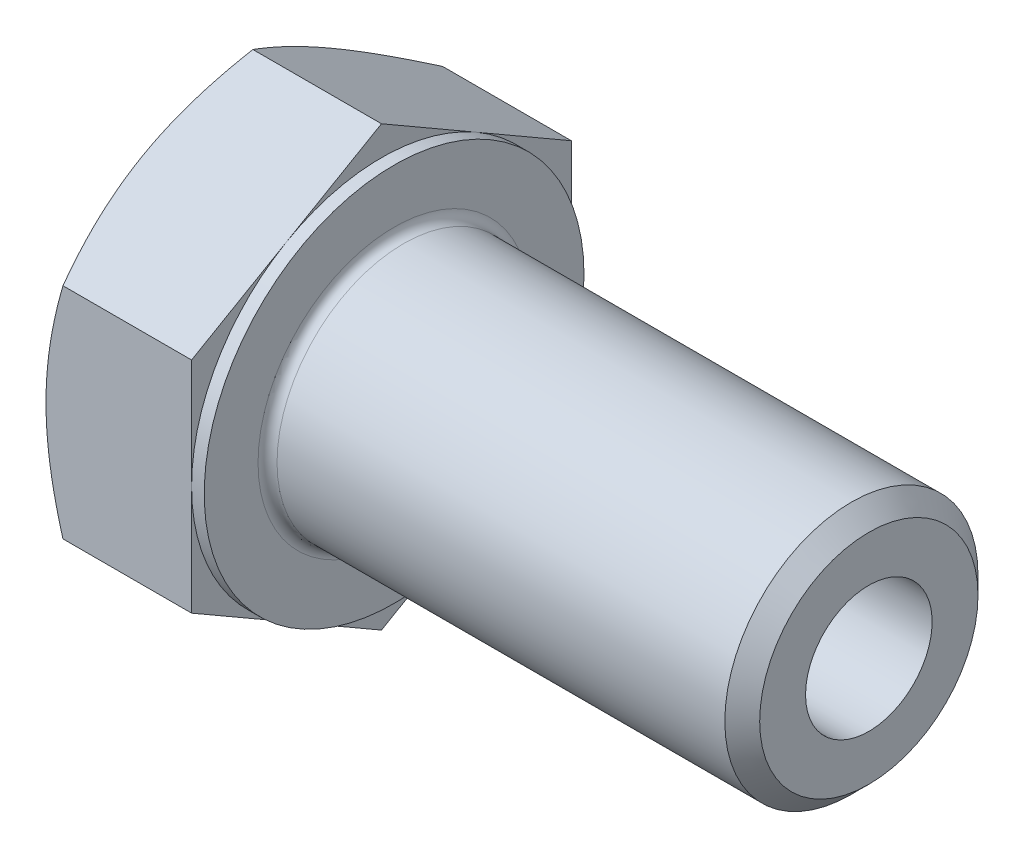
ISO-10303-21;
HEADER;
FILE_DESCRIPTION(('STEP AP214'),'2;1');
FILE_NAME('part.step','',(''),(''),'','','');
FILE_SCHEMA(('AUTOMOTIVE_DESIGN { 1 0 10303 214 1 1 1 1 }'));
ENDSEC;
DATA;
#1=APPLICATION_CONTEXT('core data for automotive mechanical design processes');
#2=APPLICATION_PROTOCOL_DEFINITION('international standard','automotive_design',2000,#1);
#3=PRODUCT_CONTEXT('',#1,'mechanical');
#4=PRODUCT('Part','Part','',(#3));
#5=PRODUCT_RELATED_PRODUCT_CATEGORY('part','',(#4));
#6=PRODUCT_DEFINITION_FORMATION('','',#4);
#7=PRODUCT_DEFINITION_CONTEXT('part definition',#1,'design');
#8=PRODUCT_DEFINITION('design','',#6,#7);
#9=PRODUCT_DEFINITION_SHAPE('','',#8);
#10=(LENGTH_UNIT() NAMED_UNIT(*) SI_UNIT(.MILLI.,.METRE.));
#11=(NAMED_UNIT(*) PLANE_ANGLE_UNIT() SI_UNIT($,.RADIAN.));
#12=(NAMED_UNIT(*) SI_UNIT($,.STERADIAN.) SOLID_ANGLE_UNIT());
#13=UNCERTAINTY_MEASURE_WITH_UNIT(LENGTH_MEASURE(1.E-05),#10,'distance_accuracy_value','');
#14=(GEOMETRIC_REPRESENTATION_CONTEXT(3) GLOBAL_UNCERTAINTY_ASSIGNED_CONTEXT((#13)) GLOBAL_UNIT_ASSIGNED_CONTEXT((#10,
#11,#12)) REPRESENTATION_CONTEXT('',''));
#15=CARTESIAN_POINT('',(0.,0.,0.));
#16=DIRECTION('',(0.,0.,1.));
#17=DIRECTION('',(1.,0.,0.));
#18=AXIS2_PLACEMENT_3D('',#15,#16,#17);
#19=CARTESIAN_POINT('',(10.,13.856406460551,0.));
#20=DIRECTION('',(1.,0.,0.));
#21=DIRECTION('',(0.,0.,-1.));
#22=AXIS2_PLACEMENT_3D('',#19,#20,#21);
#23=PLANE('',#22);
#24=CARTESIAN_POINT('',(10.,0.,0.));
#25=DIRECTION('',(1.,0.,0.));
#26=DIRECTION('',(0.,0.,-1.));
#27=AXIS2_PLACEMENT_3D('',#24,#25,#26);
#28=CIRCLE('',#27,8.6);
#29=CARTESIAN_POINT('',(10.,0.,-8.6));
#30=VERTEX_POINT('',#29);
#31=EDGE_CURVE('E50',#30,#30,#28,.F.);
#32=ORIENTED_EDGE('',*,*,#31,.T.);
#33=EDGE_LOOP('',(#32));
#34=FACE_BOUND('',#33,.T.);
#35=CARTESIAN_POINT('',(10.,0.,0.));
#36=DIRECTION('',(1.,0.,0.));
#37=DIRECTION('',(0.,0.,-1.));
#38=AXIS2_PLACEMENT_3D('',#35,#36,#37);
#39=CIRCLE('',#38,12.);
#40=CARTESIAN_POINT('',(10.,0.,-12.));
#41=VERTEX_POINT('',#40);
#42=EDGE_CURVE('E335',#41,#41,#39,.T.);
#43=ORIENTED_EDGE('',*,*,#42,.T.);
#44=EDGE_LOOP('',(#43));
#45=FACE_BOUND('',#44,.T.);
#46=ADVANCED_FACE('F41',(#34,#45),#23,.T.);
#47=CARTESIAN_POINT('',(0.,0.,0.));
#48=DIRECTION('',(-1.,0.,0.));
#49=DIRECTION('',(0.,0.,1.));
#50=AXIS2_PLACEMENT_3D('',#47,#48,#49);
#51=CYLINDRICAL_SURFACE('',#50,8.);
#52=CARTESIAN_POINT('',(10.6,0.,0.));
#53=DIRECTION('',(1.,0.,0.));
#54=DIRECTION('',(0.,0.,-1.));
#55=AXIS2_PLACEMENT_3D('',#52,#53,#54);
#56=CIRCLE('',#55,8.);
#57=CARTESIAN_POINT('',(10.6,0.,-8.));
#58=VERTEX_POINT('',#57);
#59=EDGE_CURVE('E11',#58,#58,#56,.T.);
#60=ORIENTED_EDGE('',*,*,#59,.T.);
#61=EDGE_LOOP('',(#60));
#62=FACE_BOUND('',#61,.T.);
#63=CARTESIAN_POINT('',(38.8985,0.,0.));
#64=DIRECTION('',(-1.,0.,0.));
#65=DIRECTION('',(0.,0.,1.));
#66=AXIS2_PLACEMENT_3D('',#63,#64,#65);
#67=CIRCLE('',#66,8.);
#68=CARTESIAN_POINT('',(38.8985,0.,8.));
#69=VERTEX_POINT('',#68);
#70=EDGE_CURVE('E305',#69,#69,#67,.T.);
#71=ORIENTED_EDGE('',*,*,#70,.T.);
#72=EDGE_LOOP('',(#71));
#73=FACE_BOUND('',#72,.T.);
#74=ADVANCED_FACE('F273',(#62,#73),#51,.T.);
#75=CARTESIAN_POINT('',(40.,0.,0.));
#76=DIRECTION('',(-1.,0.,0.));
#77=DIRECTION('',(0.,0.,1.));
#78=AXIS2_PLACEMENT_3D('',#75,#76,#77);
#79=CONICAL_SURFACE('',#78,6.8985,0.785398163397439);
#80=ORIENTED_EDGE('',*,*,#70,.F.);
#81=EDGE_LOOP('',(#80));
#82=FACE_BOUND('',#81,.T.);
#83=CARTESIAN_POINT('',(40.,0.,0.));
#84=DIRECTION('',(-1.,0.,0.));
#85=DIRECTION('',(0.,0.,1.));
#86=AXIS2_PLACEMENT_3D('',#83,#84,#85);
#87=CIRCLE('',#86,6.8985);
#88=CARTESIAN_POINT('',(40.,0.,6.8985));
#89=VERTEX_POINT('',#88);
#90=EDGE_CURVE('E302',#89,#89,#87,.T.);
#91=ORIENTED_EDGE('',*,*,#90,.T.);
#92=EDGE_LOOP('',(#91));
#93=FACE_BOUND('',#92,.T.);
#94=ADVANCED_FACE('F278',(#82,#93),#79,.T.);
#95=CARTESIAN_POINT('',(40.,0.,0.));
#96=DIRECTION('',(-1.,0.,0.));
#97=DIRECTION('',(0.,0.,1.));
#98=AXIS2_PLACEMENT_3D('',#95,#96,#97);
#99=PLANE('',#98);
#100=CARTESIAN_POINT('',(40.,0.,0.));
#101=DIRECTION('',(-1.,0.,0.));
#102=DIRECTION('',(0.,0.,1.));
#103=AXIS2_PLACEMENT_3D('',#100,#101,#102);
#104=CIRCLE('',#103,4.);
#105=CARTESIAN_POINT('',(40.,0.,4.));
#106=VERTEX_POINT('',#105);
#107=EDGE_CURVE('E157',#106,#106,#104,.T.);
#108=ORIENTED_EDGE('',*,*,#107,.T.);
#109=EDGE_LOOP('',(#108));
#110=FACE_BOUND('',#109,.T.);
#111=ORIENTED_EDGE('',*,*,#90,.F.);
#112=EDGE_LOOP('',(#111));
#113=FACE_BOUND('',#112,.T.);
#114=ADVANCED_FACE('F285',(#110,#113),#99,.F.);
#115=CARTESIAN_POINT('',(9.2,12.,0.));
#116=DIRECTION('',(1.,0.,0.));
#117=DIRECTION('',(0.,0.,-1.));
#118=AXIS2_PLACEMENT_3D('',#115,#116,#117);
#119=PLANE('',#118);
#120=DIRECTION('',(0.,0.500000000000001,0.866025403784438));
#121=VECTOR('',#120,1.);
#122=CARTESIAN_POINT('',(9.2,6.92820323027549,-12.));
#123=LINE('',#122,#121);
#124=CARTESIAN_POINT('',(9.2,6.92820323027549,-12.));
#125=VERTEX_POINT('',#124);
#126=CARTESIAN_POINT('',(9.2,10.3923048454133,-6.00000000000002));
#127=VERTEX_POINT('',#126);
#128=EDGE_CURVE('E182',#125,#127,#123,.T.);
#129=ORIENTED_EDGE('',*,*,#128,.T.);
#130=CARTESIAN_POINT('',(9.2,0.,0.));
#131=DIRECTION('',(-1.,0.,0.));
#132=DIRECTION('',(0.,0.,1.));
#133=AXIS2_PLACEMENT_3D('',#130,#131,#132);
#134=CIRCLE('',#133,12.);
#135=CARTESIAN_POINT('',(9.2,0.,-12.));
#136=VERTEX_POINT('',#135);
#137=EDGE_CURVE('E57',#127,#136,#134,.T.);
#138=ORIENTED_EDGE('',*,*,#137,.T.);
#139=DIRECTION('',(0.,1.,0.));
#140=VECTOR('',#139,1.);
#141=CARTESIAN_POINT('',(9.2,6.92820323027549,-12.));
#142=LINE('',#141,#140);
#143=EDGE_CURVE('E339',#136,#125,#142,.T.);
#144=ORIENTED_EDGE('',*,*,#143,.T.);
#145=EDGE_LOOP('',(#129,#138,#144));
#146=FACE_BOUND('',#145,.T.);
#147=ADVANCED_FACE('F288',(#146),#119,.T.);
#148=CARTESIAN_POINT('',(9.2,13.856406460551,0.));
#149=VERTEX_POINT('',#148);
#150=EDGE_CURVE('E179',#127,#149,#123,.T.);
#151=ORIENTED_EDGE('',*,*,#150,.T.);
#152=DIRECTION('',(0.,-0.500000000000001,0.866025403784438));
#153=VECTOR('',#152,1.);
#154=CARTESIAN_POINT('',(9.2,13.856406460551,0.));
#155=LINE('',#154,#153);
#156=CARTESIAN_POINT('',(9.2,10.3923048454133,6.00000000000001));
#157=VERTEX_POINT('',#156);
#158=EDGE_CURVE('E178',#149,#157,#155,.T.);
#159=ORIENTED_EDGE('',*,*,#158,.T.);
#160=EDGE_CURVE('E163',#157,#127,#134,.T.);
#161=ORIENTED_EDGE('',*,*,#160,.T.);
#162=EDGE_LOOP('',(#151,#159,#161));
#163=FACE_BOUND('',#162,.T.);
#164=ADVANCED_FACE('F295',(#163),#119,.T.);
#165=CARTESIAN_POINT('',(9.2,6.9282032302755,12.));
#166=VERTEX_POINT('',#165);
#167=EDGE_CURVE('E139',#157,#166,#155,.T.);
#168=ORIENTED_EDGE('',*,*,#167,.T.);
#169=DIRECTION('',(0.,-1.,0.));
#170=VECTOR('',#169,1.);
#171=CARTESIAN_POINT('',(9.2,6.9282032302755,12.));
#172=LINE('',#171,#170);
#173=CARTESIAN_POINT('',(9.2,0.,12.));
#174=VERTEX_POINT('',#173);
#175=EDGE_CURVE('E133',#166,#174,#172,.T.);
#176=ORIENTED_EDGE('',*,*,#175,.T.);
#177=EDGE_CURVE('E137',#174,#157,#134,.T.);
#178=ORIENTED_EDGE('',*,*,#177,.T.);
#179=EDGE_LOOP('',(#168,#176,#178));
#180=FACE_BOUND('',#179,.T.);
#181=ADVANCED_FACE('F135',(#180),#119,.T.);
#182=CARTESIAN_POINT('',(9.2,-6.92820323027548,12.));
#183=VERTEX_POINT('',#182);
#184=EDGE_CURVE('E144',#174,#183,#172,.T.);
#185=ORIENTED_EDGE('',*,*,#184,.T.);
#186=DIRECTION('',(0.,-0.500000000000002,-0.866025403784438));
#187=VECTOR('',#186,1.);
#188=CARTESIAN_POINT('',(9.2,-13.856406460551,0.));
#189=LINE('',#188,#187);
#190=CARTESIAN_POINT('',(9.2,-10.3923048454132,6.00000000000002));
#191=VERTEX_POINT('',#190);
#192=EDGE_CURVE('E151',#183,#191,#189,.T.);
#193=ORIENTED_EDGE('',*,*,#192,.T.);
#194=EDGE_CURVE('E148',#191,#174,#134,.T.);
#195=ORIENTED_EDGE('',*,*,#194,.T.);
#196=EDGE_LOOP('',(#185,#193,#195));
#197=FACE_BOUND('',#196,.T.);
#198=ADVANCED_FACE('F149',(#197),#119,.T.);
#199=CARTESIAN_POINT('',(9.2,-13.856406460551,0.));
#200=VERTEX_POINT('',#199);
#201=EDGE_CURVE('E172',#191,#200,#189,.T.);
#202=ORIENTED_EDGE('',*,*,#201,.T.);
#203=DIRECTION('',(0.,0.5,-0.866025403784439));
#204=VECTOR('',#203,1.);
#205=CARTESIAN_POINT('',(9.2,-6.92820323027552,-12.));
#206=LINE('',#205,#204);
#207=CARTESIAN_POINT('',(9.2,-10.3923048454133,-6.));
#208=VERTEX_POINT('',#207);
#209=EDGE_CURVE('E529',#200,#208,#206,.T.);
#210=ORIENTED_EDGE('',*,*,#209,.T.);
#211=EDGE_CURVE('E156',#208,#191,#134,.T.);
#212=ORIENTED_EDGE('',*,*,#211,.T.);
#213=EDGE_LOOP('',(#202,#210,#212));
#214=FACE_BOUND('',#213,.T.);
#215=ADVANCED_FACE('F467',(#214),#119,.T.);
#216=CARTESIAN_POINT('',(9.2,-6.92820323027552,-12.));
#217=VERTEX_POINT('',#216);
#218=EDGE_CURVE('E165',#208,#217,#206,.T.);
#219=ORIENTED_EDGE('',*,*,#218,.T.);
#220=EDGE_CURVE('E341',#217,#136,#142,.T.);
#221=ORIENTED_EDGE('',*,*,#220,.T.);
#222=EDGE_CURVE('E350',#136,#208,#134,.T.);
#223=ORIENTED_EDGE('',*,*,#222,.T.);
#224=EDGE_LOOP('',(#219,#221,#223));
#225=FACE_BOUND('',#224,.T.);
#226=ADVANCED_FACE('F296',(#225),#119,.T.);
#227=CARTESIAN_POINT('',(0.,0.,0.));
#228=DIRECTION('',(-1.,0.,0.));
#229=DIRECTION('',(0.,0.,1.));
#230=AXIS2_PLACEMENT_3D('',#227,#228,#229);
#231=CYLINDRICAL_SURFACE('',#230,12.);
#232=ORIENTED_EDGE('',*,*,#137,.F.);
#233=ORIENTED_EDGE('',*,*,#160,.F.);
#234=ORIENTED_EDGE('',*,*,#177,.F.);
#235=ORIENTED_EDGE('',*,*,#194,.F.);
#236=ORIENTED_EDGE('',*,*,#211,.F.);
#237=ORIENTED_EDGE('',*,*,#222,.F.);
#238=EDGE_LOOP('',(#232,#233,#234,#235,#236,#237));
#239=FACE_BOUND('',#238,.T.);
#240=ORIENTED_EDGE('',*,*,#42,.F.);
#241=EDGE_LOOP('',(#240));
#242=FACE_BOUND('',#241,.T.);
#243=ADVANCED_FACE('F160',(#239,#242),#231,.T.);
#244=CARTESIAN_POINT('',(0.,13.856406460551,0.));
#245=DIRECTION('',(1.,0.,0.));
#246=DIRECTION('',(0.,0.,-1.));
#247=AXIS2_PLACEMENT_3D('',#244,#245,#246);
#248=PLANE('',#247);
#249=CARTESIAN_POINT('',(0.,0.,0.));
#250=DIRECTION('',(-1.,0.,0.));
#251=DIRECTION('',(0.,0.,1.));
#252=AXIS2_PLACEMENT_3D('',#249,#250,#251);
#253=CIRCLE('',#252,4.);
#254=CARTESIAN_POINT('',(0.,0.,4.));
#255=VERTEX_POINT('',#254);
#256=EDGE_CURVE('E523',#255,#255,#253,.T.);
#257=ORIENTED_EDGE('',*,*,#256,.F.);
#258=EDGE_LOOP('',(#257));
#259=FACE_BOUND('',#258,.T.);
#260=CARTESIAN_POINT('',(0.,0.,0.));
#261=DIRECTION('',(1.,0.,0.));
#262=DIRECTION('',(0.,0.,-1.));
#263=AXIS2_PLACEMENT_3D('',#260,#261,#262);
#264=CIRCLE('',#263,12.);
#265=CARTESIAN_POINT('',(0.,0.,-12.));
#266=VERTEX_POINT('',#265);
#267=CARTESIAN_POINT('',(0.,10.3923048454133,-6.00000000000002));
#268=VERTEX_POINT('',#267);
#269=EDGE_CURVE('E334',#266,#268,#264,.T.);
#270=ORIENTED_EDGE('',*,*,#269,.F.);
#271=CARTESIAN_POINT('',(0.,-10.3923048454133,-6.));
#272=VERTEX_POINT('',#271);
#273=EDGE_CURVE('E329',#272,#266,#264,.T.);
#274=ORIENTED_EDGE('',*,*,#273,.F.);
#275=CARTESIAN_POINT('',(0.,-10.3923048454132,6.00000000000002));
#276=VERTEX_POINT('',#275);
#277=EDGE_CURVE('E333',#276,#272,#264,.T.);
#278=ORIENTED_EDGE('',*,*,#277,.F.);
#279=CARTESIAN_POINT('',(0.,0.,12.));
#280=VERTEX_POINT('',#279);
#281=EDGE_CURVE('E405',#280,#276,#264,.T.);
#282=ORIENTED_EDGE('',*,*,#281,.F.);
#283=CARTESIAN_POINT('',(0.,0.,0.));
#284=DIRECTION('',(-1.,0.,0.));
#285=DIRECTION('',(0.,0.,1.));
#286=AXIS2_PLACEMENT_3D('',#283,#284,#285);
#287=CIRCLE('',#286,12.);
#288=CARTESIAN_POINT('',(0.,10.3923048454133,6.00000000000001));
#289=VERTEX_POINT('',#288);
#290=EDGE_CURVE('E183',#280,#289,#287,.T.);
#291=ORIENTED_EDGE('',*,*,#290,.T.);
#292=EDGE_CURVE('E401',#268,#289,#264,.T.);
#293=ORIENTED_EDGE('',*,*,#292,.F.);
#294=EDGE_LOOP('',(#270,#274,#278,#282,#291,#293));
#295=FACE_BOUND('',#294,.T.);
#296=ADVANCED_FACE('F216',(#259,#295),#248,.F.);
#297=CARTESIAN_POINT('',(0.,0.,0.));
#298=DIRECTION('',(1.,0.,0.));
#299=DIRECTION('',(0.,0.,-1.));
#300=AXIS2_PLACEMENT_3D('',#297,#298,#299);
#301=CONICAL_SURFACE('',#300,12.,1.0471975511966);
#302=CARTESIAN_POINT('',(1.07186343722448,6.92808776022166,12.0002));
#303=CARTESIAN_POINT('',(0.983949632185858,7.08038456011318,11.7364142047577));
#304=CARTESIAN_POINT('',(0.900025997556665,7.2332492006783,11.4716448806182));
#305=CARTESIAN_POINT('',(0.741266218872839,7.54020434011448,10.9399829834703));
#306=CARTESIAN_POINT('',(0.666433063673581,7.69429522451413,10.6730897427069));
#307=CARTESIAN_POINT('',(0.45701753985415,8.15905073005026,9.86810959402099));
#308=CARTESIAN_POINT('',(0.337903236722849,8.47155003173404,9.3268449261749));
#309=CARTESIAN_POINT('',(0.198231061003142,8.93919090681136,8.51686717084501));
#310=CARTESIAN_POINT('',(0.158443797040442,9.09293539869503,8.25057389951863));
#311=CARTESIAN_POINT('',(0.0917233692170888,9.4011362296884,7.71675440130316));
#312=CARTESIAN_POINT('',(0.0647904527677739,9.55559258244173,7.44922815078262));
#313=CARTESIAN_POINT('',(0.0244685919169251,9.86476279544466,6.91372963367465));
#314=CARTESIAN_POINT('',(0.0110635528823176,10.0194761298182,6.64575827793128));
#315=CARTESIAN_POINT('',(-0.00191690624283284,10.3290461538973,6.10956726772596));
#316=CARTESIAN_POINT('',(-0.00149275363726559,10.4839028390257,5.84134762119196));
#317=CARTESIAN_POINT('',(0.0122200193427731,10.7734076259435,5.3399106212159));
#318=CARTESIAN_POINT('',(0.0238359825785317,10.908076374328,5.10665750682225));
#319=CARTESIAN_POINT('',(0.0573080088723795,11.1771041340893,4.64068775826924));
#320=CARTESIAN_POINT('',(0.0791647962662195,11.3114631228811,4.40797116322823));
#321=CARTESIAN_POINT('',(0.132737416542912,11.5797983456356,3.94320092395706));
#322=CARTESIAN_POINT('',(0.164461392492927,11.7137741708857,3.711147987638));
#323=CARTESIAN_POINT('',(0.237211775670445,11.9810977118116,3.24813003269502));
#324=CARTESIAN_POINT('',(0.278238815183201,12.1144453841659,3.01716508910646));
#325=CARTESIAN_POINT('',(0.416311653281806,12.5192297269844,2.31605804123633));
#326=CARTESIAN_POINT('',(0.52712488833933,12.789494193517,1.84794625372147));
#327=CARTESIAN_POINT('',(0.77862576693789,13.3259930983136,0.918702892408577));
#328=CARTESIAN_POINT('',(0.91925434265939,13.5922344058351,0.457559420707844));
#329=CARTESIAN_POINT('',(1.07186343722448,13.8565219306049,-0.000199999999999918));
#330=B_SPLINE_CURVE_WITH_KNOTS('',3,(#302,#303,#304,#305,#306,#307,#308,#309,#310,#311,#312,
#313,#314,#315,#316,#317,#318,#319,#320,#321,#322,#323,#324,#325,#326,#327,#328,#329),
.UNSPECIFIED.,.F.,.F.,(4,2,2,2,2,2,2,2,2,2,2,2,2,4),(0.,0.951004872251246,1.90232158356437,
3.80900466161369,4.7389455141357,5.66890426477609,6.59775529889866,7.5265776327693,
8.33514643820579,9.14377244252749,9.95306755799766,10.7624176939264,12.4167102786892,
14.0677556316691),.UNSPECIFIED.);
#331=CARTESIAN_POINT('',(1.07179676972449,13.856406460551,0.));
#332=VERTEX_POINT('',#331);
#333=EDGE_CURVE('E237',#289,#332,#330,.T.);
#334=ORIENTED_EDGE('',*,*,#333,.T.);
#335=CARTESIAN_POINT('',(1.07186343722448,13.8565219306049,0.0002));
#336=CARTESIAN_POINT('',(0.983949632185864,13.7042251307133,-0.263585795242262));
#337=CARTESIAN_POINT('',(0.900025997556671,13.5513604901482,-0.528355119381799));
#338=CARTESIAN_POINT('',(0.741266218872845,13.244405350712,-1.06001701652966));
#339=CARTESIAN_POINT('',(0.666433063673586,13.0903144663124,-1.32691025729307));
#340=CARTESIAN_POINT('',(0.457017539854154,12.6255589607763,-2.13189040597901));
#341=CARTESIAN_POINT('',(0.337903236722851,12.3130596590925,-2.6731550738251));
#342=CARTESIAN_POINT('',(0.198231061003145,11.8454187840152,-3.483132829155));
#343=CARTESIAN_POINT('',(0.158443797040445,11.6916742921315,-3.74942610048137));
#344=CARTESIAN_POINT('',(0.0917233692170902,11.3834734611381,-4.28324559869684));
#345=CARTESIAN_POINT('',(0.0647904527677737,11.2290171083848,-4.55077184921738));
#346=CARTESIAN_POINT('',(0.0244685919169238,10.9198468953819,-5.08627036632535));
#347=CARTESIAN_POINT('',(0.0110635528823167,10.7651335610083,-5.35424172206873));
#348=CARTESIAN_POINT('',(-0.001916906242834,10.4555635369292,-5.89043273227404));
#349=CARTESIAN_POINT('',(-0.00149275363726746,10.3007068518009,-6.15865237880804));
#350=CARTESIAN_POINT('',(0.01222001934277,10.011202064883,-6.6600893787841));
#351=CARTESIAN_POINT('',(0.0238359825785281,9.87653331649855,-6.89334249317776));
#352=CARTESIAN_POINT('',(0.0573080088723761,9.60750555673725,-7.35931224173077));
#353=CARTESIAN_POINT('',(0.0791647962662168,9.47314656794543,-7.59202883677177));
#354=CARTESIAN_POINT('',(0.132737416542909,9.20481134519089,-8.05679907604294));
#355=CARTESIAN_POINT('',(0.164461392492922,9.07083551994084,-8.288852012362));
#356=CARTESIAN_POINT('',(0.237211775670439,8.80351197901488,-8.75186996730498));
#357=CARTESIAN_POINT('',(0.278238815183196,8.67016430666066,-8.98283491089354));
#358=CARTESIAN_POINT('',(0.416311653281801,8.26537996384209,-9.68394195876367));
#359=CARTESIAN_POINT('',(0.527124888339324,7.99511549730955,-10.1520537462785));
#360=CARTESIAN_POINT('',(0.778625766937882,7.45861659251288,-11.0812971075914));
#361=CARTESIAN_POINT('',(0.919254342659381,7.19237528499142,-11.5424405792922));
#362=CARTESIAN_POINT('',(1.07186343722447,6.92808776022166,-12.0002));
#363=B_SPLINE_CURVE_WITH_KNOTS('',3,(#335,#336,#337,#338,#339,#340,#341,#342,#343,#344,#345,
#346,#347,#348,#349,#350,#351,#352,#353,#354,#355,#356,#357,#358,#359,#360,#361,#362),
.UNSPECIFIED.,.F.,.F.,(4,2,2,2,2,2,2,2,2,2,2,2,2,4),(0.,0.951004872251245,1.90232158356437,
3.80900466161369,4.7389455141357,5.6689042647761,6.59775529889866,7.52657763276931,
8.33514643820579,9.1437724425275,9.95306755799766,10.7624176939264,12.4167102786892,
14.0677556316691),.UNSPECIFIED.);
#364=EDGE_CURVE('E65',#332,#268,#363,.T.);
#365=ORIENTED_EDGE('',*,*,#364,.T.);
#366=ORIENTED_EDGE('',*,*,#292,.T.);
#367=EDGE_LOOP('',(#334,#365,#366));
#368=FACE_BOUND('',#367,.T.);
#369=ADVANCED_FACE('F402',(#368),#301,.T.);
#370=CARTESIAN_POINT('',(5.93796522499158,-18.7780422876809,12.));
#371=CARTESIAN_POINT('',(5.81013580153169,-18.5152821742341,12.));
#372=CARTESIAN_POINT('',(5.68293119845562,-18.2522182359297,12.));
#373=CARTESIAN_POINT('',(5.42991281410035,-17.7254193681017,12.));
#374=CARTESIAN_POINT('',(5.30409904630054,-17.4616844321054,12.));
#375=CARTESIAN_POINT('',(4.92892368290874,-16.6693101743881,12.));
#376=CARTESIAN_POINT('',(4.68186469152993,-16.1395765656331,12.));
#377=CARTESIAN_POINT('',(4.19405479952981,-15.0738169190077,12.));
#378=CARTESIAN_POINT('',(3.95334413341025,-14.5377724221017,12.));
#379=CARTESIAN_POINT('',(3.48154718674622,-13.461479060208,12.));
#380=CARTESIAN_POINT('',(3.25046046260964,-12.9212303903669,12.));
#381=CARTESIAN_POINT('',(2.79294900667128,-11.8175688689819,12.));
#382=CARTESIAN_POINT('',(2.566936558955,-11.2539842320577,12.));
#383=CARTESIAN_POINT('',(2.13161283273162,-10.1202797331247,12.));
#384=CARTESIAN_POINT('',(1.9223034050657,-9.55015915485904,12.));
#385=CARTESIAN_POINT('',(1.52576124918552,-8.40350794466344,12.));
#386=CARTESIAN_POINT('',(1.33848523718245,-7.82699240007886,12.));
#387=CARTESIAN_POINT('',(0.991896700180052,-6.66563869600159,12.));
#388=CARTESIAN_POINT('',(0.832575542892158,-6.08080316618916,12.));
#389=CARTESIAN_POINT('',(0.620681197025564,-5.19882791551968,12.));
#390=CARTESIAN_POINT('',(0.554713150855284,-4.90488790342144,12.));
#391=CARTESIAN_POINT('',(0.432574422995975,-4.31496880701139,12.));
#392=CARTESIAN_POINT('',(0.376403548449435,-4.01898976295722,12.));
#393=CARTESIAN_POINT('',(0.274840044165104,-3.42518449183523,12.));
#394=CARTESIAN_POINT('',(0.229447213467059,-3.12735829931438,12.));
#395=CARTESIAN_POINT('',(0.150338666864209,-2.53016033534829,12.));
#396=CARTESIAN_POINT('',(0.116622484244825,-2.23078862616276,12.));
#397=CARTESIAN_POINT('',(0.0619693201283202,-1.63489952034461,12.));
#398=CARTESIAN_POINT('',(0.0408679219512412,-1.33839729705372,12.));
#399=CARTESIAN_POINT('',(0.0112310519021931,-0.744766224338099,12.));
#400=CARTESIAN_POINT('',(0.0026953667966268,-0.447637385632396,12.));
#401=CARTESIAN_POINT('',(-0.00160621157202283,0.146715096942953,12.));
#402=CARTESIAN_POINT('',(0.00262788821472258,0.443938740760913,12.));
#403=CARTESIAN_POINT('',(0.0237602868313387,1.03793867900079,12.));
#404=CARTESIAN_POINT('',(0.0406591751133817,1.33471495195668,12.));
#405=CARTESIAN_POINT('',(0.0957363037225961,2.04293812544914,12.));
#406=CARTESIAN_POINT('',(0.139644388869436,2.45394931182507,12.));
#407=CARTESIAN_POINT('',(0.249393763135937,3.27301119833397,12.));
#408=CARTESIAN_POINT('',(0.315237895547367,3.6810615076766,12.));
#409=CARTESIAN_POINT('',(0.542190666924397,4.90025554060107,12.));
#410=CARTESIAN_POINT('',(0.732681274216211,5.70600726238711,12.));
#411=CARTESIAN_POINT('',(1.06415793334628,6.91101760118606,12.));
#412=CARTESIAN_POINT('',(1.18384338751808,7.31649624625237,12.));
#413=CARTESIAN_POINT('',(1.43593551476423,8.12351840181153,12.));
#414=CARTESIAN_POINT('',(1.56834227450982,8.52506188547328,12.));
#415=CARTESIAN_POINT('',(1.84372865812762,9.32433402651666,12.));
#416=CARTESIAN_POINT('',(1.98670500371921,9.72206382387897,12.));
#417=CARTESIAN_POINT('',(2.28151949374365,10.5142091061849,12.));
#418=CARTESIAN_POINT('',(2.43335751674011,10.9086246364611,12.));
#419=CARTESIAN_POINT('',(2.81137815071348,11.8636440545741,12.));
#420=CARTESIAN_POINT('',(3.04143185567877,12.4227131308578,12.));
#421=CARTESIAN_POINT('',(3.51333410611206,13.5358669332653,12.));
#422=CARTESIAN_POINT('',(3.75518348678293,14.0899513031432,12.));
#423=CARTESIAN_POINT('',(4.24823475653158,15.1941025186567,12.));
#424=CARTESIAN_POINT('',(4.49943904043689,15.7441682918316,12.));
#425=CARTESIAN_POINT('',(5.00924552887373,16.8408349536019,12.));
#426=CARTESIAN_POINT('',(5.26784754956298,17.38743592789,12.));
#427=CARTESIAN_POINT('',(5.79133879928482,18.4784293923002,12.));
#428=CARTESIAN_POINT('',(6.05623527465222,19.0228183989982,12.));
#429=CARTESIAN_POINT('',(6.59090796254077,20.1091945794083,12.));
#430=CARTESIAN_POINT('',(6.86068419945746,20.6511817410959,12.));
#431=CARTESIAN_POINT('',(7.40421496208665,21.7330545936328,12.));
#432=CARTESIAN_POINT('',(7.677968891257,22.2729405845111,12.));
#433=CARTESIAN_POINT('',(8.22882461462084,23.3510028742049,12.));
#434=CARTESIAN_POINT('',(8.50592642242828,23.8891791660568,12.));
#435=CARTESIAN_POINT('',(9.29226596146125,25.4066579940567,12.));
#436=CARTESIAN_POINT('',(9.80475659623533,26.3842748096138,12.));
#437=CARTESIAN_POINT('',(10.8366490575024,28.3358962609435,12.));
#438=CARTESIAN_POINT('',(11.3560511647271,29.3099007479223,12.));
#439=CARTESIAN_POINT('',(12.3986980712295,31.2524398572292,12.));
#440=CARTESIAN_POINT('',(12.9219285874181,32.2209821512087,12.));
#441=CARTESIAN_POINT('',(13.709817261168,33.6721037842397,12.));
#442=CARTESIAN_POINT('',(13.9729461083086,34.1555146940213,12.));
#443=CARTESIAN_POINT('',(14.5001155834576,35.1218381868036,12.));
#444=CARTESIAN_POINT('',(14.7641562100751,35.6047507705631,12.));
#445=CARTESIAN_POINT('',(15.0285993289473,36.0874429112689,12.));
#446=B_SPLINE_CURVE_WITH_KNOTS('',3,(#370,#371,#372,#373,#374,#375,#376,#377,#378,#379,#380,
#381,#382,#383,#384,#385,#386,#387,#388,#389,#390,#391,#392,#393,#394,#395,#396,#397,#398,#399,
#400,#401,#402,#403,#404,#405,#406,#407,#408,#409,#410,#411,#412,#413,#414,#415,#416,#417,#418,
#419,#420,#421,#422,#423,#424,#425,#426,#427,#428,#429,#430,#431,#432,#433,#434,#435,#436,#437,
#438,#439,#440,#441,#442,#443,#444,#445),.UNSPECIFIED.,.F.,.F.,(4,2,2,2,2,2,2,2,2,2,2,2,2,2,2,2,
2,2,2,2,2,2,2,2,2,2,2,2,2,2,2,2,2,2,2,2,2,4),(0.,0.876610778943413,1.75323004620523,
3.50671945197806,5.26947518067904,7.03214956933033,8.85359042595664,10.6752328347611,
12.4932347351832,14.3106742559303,15.2142921518805,16.117892258087,17.0214755150421,
17.9250226516858,18.816520871687,19.7080039632539,20.5994865696161,21.4910106704728,
22.7303633484054,23.9698767304575,26.4502079763428,27.7184187234137,28.9866381115161,
30.2544657836991,31.5222760862275,33.3357454112635,35.1493433274816,36.9634087547281,
38.7774291394606,40.5936500751824,42.4098800933003,44.2258404831105,46.0418082599001,
49.3531754129826,52.6646774810079,55.9671781132062,57.6183303465533,59.2694800621133),.UNSPECIFIED.);
#447=CARTESIAN_POINT('',(1.07179676972448,6.9282032302755,12.));
#448=VERTEX_POINT('',#447);
#449=EDGE_CURVE('E252',#280,#448,#446,.T.);
#450=ORIENTED_EDGE('',*,*,#449,.T.);
#451=EDGE_CURVE('E251',#448,#289,#330,.T.);
#452=ORIENTED_EDGE('',*,*,#451,.T.);
#453=ORIENTED_EDGE('',*,*,#290,.F.);
#454=EDGE_LOOP('',(#450,#452,#453));
#455=FACE_BOUND('',#454,.T.);
#456=ADVANCED_FACE('F398',(#455),#301,.T.);
#457=CARTESIAN_POINT('',(1.07179676972448,-6.92820323027548,12.));
#458=VERTEX_POINT('',#457);
#459=EDGE_CURVE('E306',#458,#280,#446,.T.);
#460=ORIENTED_EDGE('',*,*,#459,.T.);
#461=ORIENTED_EDGE('',*,*,#281,.T.);
#462=CARTESIAN_POINT('',(1.07186343722448,-13.8565219306049,-0.000200000000000067));
#463=CARTESIAN_POINT('',(0.983949632185868,-13.7042251307133,0.263585795242262));
#464=CARTESIAN_POINT('',(0.900025997556673,-13.5513604901482,0.5283551193818));
#465=CARTESIAN_POINT('',(0.741266218872847,-13.244405350712,1.06001701652966));
#466=CARTESIAN_POINT('',(0.666433063673588,-13.0903144663124,1.32691025729307));
#467=CARTESIAN_POINT('',(0.457017539854155,-12.6255589607763,2.13189040597901));
#468=CARTESIAN_POINT('',(0.337903236722853,-12.3130596590925,2.6731550738251));
#469=CARTESIAN_POINT('',(0.198231061003145,-11.8454187840152,3.48313282915499));
#470=CARTESIAN_POINT('',(0.158443797040444,-11.6916742921315,3.74942610048137));
#471=CARTESIAN_POINT('',(0.0917233692170902,-11.3834734611381,4.28324559869684));
#472=CARTESIAN_POINT('',(0.0647904527677749,-11.2290171083848,4.55077184921738));
#473=CARTESIAN_POINT('',(0.0244685919169247,-10.9198468953819,5.08627036632535));
#474=CARTESIAN_POINT('',(0.011063552882316,-10.7651335610083,5.35424172206872));
#475=CARTESIAN_POINT('',(-0.00191690624283627,-10.4555635369292,5.89043273227404));
#476=CARTESIAN_POINT('',(-0.00149275363726982,-10.3007068518009,6.15865237880804));
#477=CARTESIAN_POINT('',(0.0122200193427683,-10.011202064883,6.6600893787841));
#478=CARTESIAN_POINT('',(0.0238359825785271,-9.87653331649855,6.89334249317775));
#479=CARTESIAN_POINT('',(0.057308008872375,-9.60750555673724,7.35931224173077));
#480=CARTESIAN_POINT('',(0.079164796266215,-9.47314656794543,7.59202883677177));
#481=CARTESIAN_POINT('',(0.132737416542906,-9.20481134519089,8.05679907604294));
#482=CARTESIAN_POINT('',(0.164461392492919,-9.07083551994083,8.288852012362));
#483=CARTESIAN_POINT('',(0.237211775670436,-8.80351197901487,8.75186996730498));
#484=CARTESIAN_POINT('',(0.278238815183194,-8.67016430666065,8.98283491089354));
#485=CARTESIAN_POINT('',(0.416311653281801,-8.26537996384209,9.68394195876367));
#486=CARTESIAN_POINT('',(0.527124888339323,-7.99511549730954,10.1520537462785));
#487=CARTESIAN_POINT('',(0.778625766937878,-7.45861659251287,11.0812971075914));
#488=CARTESIAN_POINT('',(0.919254342659377,-7.19237528499141,11.5424405792922));
#489=CARTESIAN_POINT('',(1.07186343722447,-6.92808776022164,12.0002));
#490=B_SPLINE_CURVE_WITH_KNOTS('',3,(#462,#463,#464,#465,#466,#467,#468,#469,#470,#471,#472,
#473,#474,#475,#476,#477,#478,#479,#480,#481,#482,#483,#484,#485,#486,#487,#488,#489),
.UNSPECIFIED.,.F.,.F.,(4,2,2,2,2,2,2,2,2,2,2,2,2,4),(0.,0.951004872251246,1.90232158356438,
3.80900466161369,4.73894551413571,5.6689042647761,6.59775529889866,7.52657763276931,
8.3351464382058,9.1437724425275,9.95306755799767,10.7624176939264,12.4167102786892,
14.0677556316692),.UNSPECIFIED.);
#491=EDGE_CURVE('E239',#276,#458,#490,.T.);
#492=ORIENTED_EDGE('',*,*,#491,.T.);
#493=EDGE_LOOP('',(#460,#461,#492));
#494=FACE_BOUND('',#493,.T.);
#495=ADVANCED_FACE('F205',(#494),#301,.T.);
#496=CARTESIAN_POINT('',(1.07179676972449,-13.856406460551,0.));
#497=VERTEX_POINT('',#496);
#498=EDGE_CURVE('E230',#497,#276,#490,.T.);
#499=ORIENTED_EDGE('',*,*,#498,.T.);
#500=ORIENTED_EDGE('',*,*,#277,.T.);
#501=CARTESIAN_POINT('',(1.07186343722448,-6.92808776022169,-12.0002));
#502=CARTESIAN_POINT('',(0.983949632185866,-7.08038456011321,-11.7364142047577));
#503=CARTESIAN_POINT('',(0.900025997556673,-7.23324920067832,-11.4716448806182));
#504=CARTESIAN_POINT('',(0.741266218872847,-7.54020434011451,-10.9399829834703));
#505=CARTESIAN_POINT('',(0.66643306367359,-7.69429522451415,-10.6730897427069));
#506=CARTESIAN_POINT('',(0.457017539854159,-8.15905073005029,-9.86810959402099));
#507=CARTESIAN_POINT('',(0.337903236722856,-8.47155003173406,-9.3268449261749));
#508=CARTESIAN_POINT('',(0.19823106100315,-8.93919090681139,-8.516867170845));
#509=CARTESIAN_POINT('',(0.158443797040451,-9.09293539869505,-8.25057389951863));
#510=CARTESIAN_POINT('',(0.0917233692170976,-9.40113622968843,-7.71675440130316));
#511=CARTESIAN_POINT('',(0.0647904527677818,-9.55559258244175,-7.44922815078262));
#512=CARTESIAN_POINT('',(0.0244685919169328,-9.86476279544468,-6.91372963367465));
#513=CARTESIAN_POINT('',(0.0110635528823257,-10.0194761298182,-6.64575827793127));
#514=CARTESIAN_POINT('',(-0.00191690624282446,-10.3290461538973,-6.10956726772596));
#515=CARTESIAN_POINT('',(-0.00149275363725739,-10.4839028390257,-5.84134762119196));
#516=CARTESIAN_POINT('',(0.0122200193427809,-10.7734076259435,-5.33991062121589));
#517=CARTESIAN_POINT('',(0.0238359825785393,-10.908076374328,-5.10665750682224));
#518=CARTESIAN_POINT('',(0.0573080088723869,-11.1771041340893,-4.64068775826923));
#519=CARTESIAN_POINT('',(0.0791647962662267,-11.3114631228811,-4.40797116322823));
#520=CARTESIAN_POINT('',(0.132737416542919,-11.5797983456356,-3.94320092395705));
#521=CARTESIAN_POINT('',(0.164461392492934,-11.7137741708857,-3.71114798763799));
#522=CARTESIAN_POINT('',(0.237211775670452,-11.9810977118117,-3.24813003269502));
#523=CARTESIAN_POINT('',(0.278238815183209,-12.1144453841659,-3.01716508910645));
#524=CARTESIAN_POINT('',(0.416311653281813,-12.5192297269844,-2.31605804123633));
#525=CARTESIAN_POINT('',(0.527124888339336,-12.789494193517,-1.84794625372147));
#526=CARTESIAN_POINT('',(0.778625766937893,-13.3259930983137,-0.918702892408577));
#527=CARTESIAN_POINT('',(0.919254342659393,-13.5922344058351,-0.457559420707845));
#528=CARTESIAN_POINT('',(1.07186343722448,-13.8565219306049,0.000199999999999864));
#529=B_SPLINE_CURVE_WITH_KNOTS('',3,(#501,#502,#503,#504,#505,#506,#507,#508,#509,#510,#511,
#512,#513,#514,#515,#516,#517,#518,#519,#520,#521,#522,#523,#524,#525,#526,#527,#528),
.UNSPECIFIED.,.F.,.F.,(4,2,2,2,2,2,2,2,2,2,2,2,2,4),(0.,0.951004872251247,1.90232158356438,
3.80900466161369,4.73894551413571,5.6689042647761,6.59775529889866,7.52657763276931,
8.33514643820579,9.1437724425275,9.95306755799766,10.7624176939264,12.4167102786892,
14.0677556316691),.UNSPECIFIED.);
#530=EDGE_CURVE('E238',#272,#497,#529,.T.);
#531=ORIENTED_EDGE('',*,*,#530,.T.);
#532=EDGE_LOOP('',(#499,#500,#531));
#533=FACE_BOUND('',#532,.T.);
#534=ADVANCED_FACE('F384',(#533),#301,.T.);
#535=CARTESIAN_POINT('',(1.07179676972448,6.92820323027549,-12.));
#536=VERTEX_POINT('',#535);
#537=EDGE_CURVE('E240',#268,#536,#363,.T.);
#538=ORIENTED_EDGE('',*,*,#537,.T.);
#539=CARTESIAN_POINT('',(5.93796522688054,-18.7780422915637,-12.));
#540=CARTESIAN_POINT('',(5.81013580338123,-18.5152821780516,-12.));
#541=CARTESIAN_POINT('',(5.68293120026577,-18.2522182396819,-12.));
#542=CARTESIAN_POINT('',(5.42991281583177,-17.7254193717232,-12.));
#543=CARTESIAN_POINT('',(5.30409904799263,-17.4616844356616,-12.));
#544=CARTESIAN_POINT('',(4.92892368448296,-16.6693101777481,-12.));
#545=CARTESIAN_POINT('',(4.68186469302576,-16.139576568862,-12.));
#546=CARTESIAN_POINT('',(4.1940548008688,-15.0738169219726,-12.));
#547=CARTESIAN_POINT('',(3.95334413467082,-14.5377724249334,-12.));
#548=CARTESIAN_POINT('',(3.48154718785123,-13.4614790627728,-12.));
#549=CARTESIAN_POINT('',(3.25046046363751,-12.9212303927977,-12.));
#550=CARTESIAN_POINT('',(2.79294900754263,-11.8175688711343,-12.));
#551=CARTESIAN_POINT('',(2.56693655974715,-11.2539842340656,-12.));
#552=CARTESIAN_POINT('',(2.13161283336958,-10.1202797348412,-12.));
#553=CARTESIAN_POINT('',(1.92230340562868,-9.55015915642869,-12.));
#554=CARTESIAN_POINT('',(1.52576124960573,-8.40350794593668,-12.));
#555=CARTESIAN_POINT('',(1.33848523753484,-7.82699240120253,-12.));
#556=CARTESIAN_POINT('',(0.991896700407879,-6.66563869682204,-12.));
#557=CARTESIAN_POINT('',(0.832575543063229,-6.08080316685593,-12.));
#558=CARTESIAN_POINT('',(0.620681197115228,-5.19882791591539,-12.));
#559=CARTESIAN_POINT('',(0.554713150915104,-4.90488790370127,-12.));
#560=CARTESIAN_POINT('',(0.432574423003702,-4.3149688070578,-12.));
#561=CARTESIAN_POINT('',(0.376403548434912,-4.01898976288609,-12.));
#562=CARTESIAN_POINT('',(0.27484004411487,-3.42518449152774,-12.));
#563=CARTESIAN_POINT('',(0.229447213403358,-3.12735829888806,-12.));
#564=CARTESIAN_POINT('',(0.150338666783353,-2.53016033468331,-12.));
#565=CARTESIAN_POINT('',(0.116622484160278,-2.23078862537795,-12.));
#566=CARTESIAN_POINT('',(0.0619693200469877,-1.63489951932263,-12.));
#567=CARTESIAN_POINT('',(0.0408679218766191,-1.33839729591442,-12.));
#568=CARTESIAN_POINT('',(0.0112310518513538,-0.744766222964395,-12.));
#569=CARTESIAN_POINT('',(0.00269536676285958,-0.447637384141607,-12.));
#570=CARTESIAN_POINT('',(-0.00160621156152504,0.146715098667038,-12.));
#571=CARTESIAN_POINT('',(0.00262788825241511,0.443938742601206,-12.));
#572=CARTESIAN_POINT('',(0.0237602869328215,1.03793868107199,-12.));
#573=CARTESIAN_POINT('',(0.040659175251461,1.33471495414258,-12.));
#574=CARTESIAN_POINT('',(0.0957363039506893,2.04293812781233,-12.));
#575=CARTESIAN_POINT('',(0.139644389149359,2.45394931425036,-12.));
#576=CARTESIAN_POINT('',(0.249393763522295,3.27301120088065,-12.));
#577=CARTESIAN_POINT('',(0.31523789598833,3.68106151028258,-12.));
#578=CARTESIAN_POINT('',(0.542190667530327,4.90025554338169,-12.));
#579=CARTESIAN_POINT('',(0.732681274933577,5.70600726527961,-12.));
#580=CARTESIAN_POINT('',(1.06415793422806,6.91101760424584,-12.));
#581=CARTESIAN_POINT('',(1.18384338845501,7.31649624936906,-12.));
#582=CARTESIAN_POINT('',(1.43593551580978,8.1235184050414,-12.));
#583=CARTESIAN_POINT('',(1.56834227560885,8.52506188875943,-12.));
#584=CARTESIAN_POINT('',(1.84372865933169,9.32433402991495,-12.));
#585=CARTESIAN_POINT('',(1.98670500497485,9.72206382733313,-12.));
#586=CARTESIAN_POINT('',(2.28151949510065,10.5142091097508,-12.));
#587=CARTESIAN_POINT('',(2.4333575181469,10.9086246400828,-12.));
#588=CARTESIAN_POINT('',(2.81137815220013,11.8636440582329,-12.));
#589=CARTESIAN_POINT('',(3.04143185719198,12.4227131344989,-12.));
#590=CARTESIAN_POINT('',(3.51333410767187,13.5358669368731,-12.));
#591=CARTESIAN_POINT('',(3.7551834883628,14.0899513067354,-12.));
#592=CARTESIAN_POINT('',(4.24823475814662,15.1941025222193,-12.));
#593=CARTESIAN_POINT('',(4.49943904206706,15.7441682953801,-12.));
#594=CARTESIAN_POINT('',(5.00924553053047,16.840834957124,-12.));
#595=CARTESIAN_POINT('',(5.26784755123118,17.3874359313995,-12.));
#596=CARTESIAN_POINT('',(5.79133880097284,18.4784293957852,-12.));
#597=CARTESIAN_POINT('',(6.0562352763486,19.0228184024713,-12.));
#598=CARTESIAN_POINT('',(6.59090796425171,20.1091945828584,-12.));
#599=CARTESIAN_POINT('',(6.86068420117458,20.651181744535,-12.));
#600=CARTESIAN_POINT('',(7.40421496381449,21.7330545970508,-12.));
#601=CARTESIAN_POINT('',(7.67796889298937,22.2729405879189,-12.));
#602=CARTESIAN_POINT('',(8.22882461636095,23.351002877593,-12.));
#603=CARTESIAN_POINT('',(8.50592642417159,23.8891791694354,-12.));
#604=CARTESIAN_POINT('',(9.29226596321909,25.4066579974227,-12.));
#605=CARTESIAN_POINT('',(9.80475659800341,26.3842748129771,-12.));
#606=CARTESIAN_POINT('',(10.8366490592887,28.3358962643026,-12.));
#607=CARTESIAN_POINT('',(11.3560511665214,29.3099007512799,-12.));
#608=CARTESIAN_POINT('',(12.3986980730396,31.2524398605869,-12.));
#609=CARTESIAN_POINT('',(12.921928589236,32.2209821545682,-12.));
#610=CARTESIAN_POINT('',(13.7098172629968,33.6721037876022,-12.));
#611=CARTESIAN_POINT('',(13.9729461101408,34.1555146973849,-12.));
#612=CARTESIAN_POINT('',(14.5001155852966,35.1218381901695,-12.));
#613=CARTESIAN_POINT('',(14.7641562119174,35.6047507739303,-12.));
#614=CARTESIAN_POINT('',(15.0285993307927,36.0874429146373,-12.));
#615=B_SPLINE_CURVE_WITH_KNOTS('',3,(#539,#540,#541,#542,#543,#544,#545,#546,#547,#548,#549,
#550,#551,#552,#553,#554,#555,#556,#557,#558,#559,#560,#561,#562,#563,#564,#565,#566,#567,#568,
#569,#570,#571,#572,#573,#574,#575,#576,#577,#578,#579,#580,#581,#582,#583,#584,#585,#586,#587,
#588,#589,#590,#591,#592,#593,#594,#595,#596,#597,#598,#599,#600,#601,#602,#603,#604,#605,#606,
#607,#608,#609,#610,#611,#612,#613,#614),.UNSPECIFIED.,.F.,.F.,(4,2,2,2,2,2,2,2,2,2,2,2,2,2,2,2,
2,2,2,2,2,2,2,2,2,2,2,2,2,2,2,2,2,2,2,2,2,4),(0.,0.876610779171213,1.75323004666083,
3.50671945288932,5.26947518205082,7.03214957116259,8.85359042827972,10.6752328375751,
12.4932347384866,14.3106742597227,15.2142921560316,16.1178922625967,17.02147551991,
17.9250226569119,18.8165208772623,19.7080039691786,20.5994865758902,21.4910106770964,
22.7303633552307,23.9698767374844,26.4502079837738,27.7184187310554,28.9866381193685,
30.2544657917616,31.5222760945001,33.3357454195175,35.1493433357168,36.963408762944,
38.7774291476574,40.5936500833578,42.4098801014544,44.2258404912437,46.0418082680123,
49.3531754211021,52.6646774891347,55.9671781213485,57.6183303547036,59.2694800702715),.UNSPECIFIED.);
#616=EDGE_CURVE('E197',#536,#266,#615,.F.);
#617=ORIENTED_EDGE('',*,*,#616,.T.);
#618=ORIENTED_EDGE('',*,*,#269,.T.);
#619=EDGE_LOOP('',(#538,#617,#618));
#620=FACE_BOUND('',#619,.T.);
#621=ADVANCED_FACE('F377',(#620),#301,.T.);
#622=CARTESIAN_POINT('',(1.07179676972449,-6.92820323027552,-12.));
#623=VERTEX_POINT('',#622);
#624=EDGE_CURVE('E198',#623,#272,#529,.T.);
#625=ORIENTED_EDGE('',*,*,#624,.T.);
#626=ORIENTED_EDGE('',*,*,#273,.T.);
#627=EDGE_CURVE('E187',#266,#623,#615,.F.);
#628=ORIENTED_EDGE('',*,*,#627,.T.);
#629=EDGE_LOOP('',(#625,#626,#628));
#630=FACE_BOUND('',#629,.T.);
#631=ADVANCED_FACE('F214',(#630),#301,.T.);
#632=CARTESIAN_POINT('',(10.,6.92820323027549,-12.));
#633=DIRECTION('',(0.,0.,1.));
#634=DIRECTION('',(0.,-1.,0.));
#635=AXIS2_PLACEMENT_3D('',#632,#633,#634);
#636=PLANE('',#635);
#637=ORIENTED_EDGE('',*,*,#220,.F.);
#638=DIRECTION('',(-1.,0.,0.));
#639=VECTOR('',#638,1.);
#640=CARTESIAN_POINT('',(10.,-6.92820323027552,-12.));
#641=LINE('',#640,#639);
#642=EDGE_CURVE('E315',#217,#623,#641,.T.);
#643=ORIENTED_EDGE('',*,*,#642,.T.);
#644=ORIENTED_EDGE('',*,*,#627,.F.);
#645=ORIENTED_EDGE('',*,*,#616,.F.);
#646=DIRECTION('',(-1.,0.,0.));
#647=VECTOR('',#646,1.);
#648=CARTESIAN_POINT('',(10.,6.92820323027549,-12.));
#649=LINE('',#648,#647);
#650=EDGE_CURVE('E310',#125,#536,#649,.T.);
#651=ORIENTED_EDGE('',*,*,#650,.F.);
#652=ORIENTED_EDGE('',*,*,#143,.F.);
#653=EDGE_LOOP('',(#637,#643,#644,#645,#651,#652));
#654=FACE_BOUND('',#653,.T.);
#655=ADVANCED_FACE('F209',(#654),#636,.F.);
#656=CARTESIAN_POINT('',(10.,-6.92820323027552,-12.));
#657=DIRECTION('',(0.,0.866025403784439,0.5));
#658=DIRECTION('',(0.,-0.5,0.866025403784439));
#659=AXIS2_PLACEMENT_3D('',#656,#657,#658);
#660=PLANE('',#659);
#661=ORIENTED_EDGE('',*,*,#209,.F.);
#662=DIRECTION('',(-1.,0.,0.));
#663=VECTOR('',#662,1.);
#664=CARTESIAN_POINT('',(10.,-13.856406460551,0.));
#665=LINE('',#664,#663);
#666=EDGE_CURVE('E318',#200,#497,#665,.T.);
#667=ORIENTED_EDGE('',*,*,#666,.T.);
#668=ORIENTED_EDGE('',*,*,#530,.F.);
#669=ORIENTED_EDGE('',*,*,#624,.F.);
#670=ORIENTED_EDGE('',*,*,#642,.F.);
#671=ORIENTED_EDGE('',*,*,#218,.F.);
#672=EDGE_LOOP('',(#661,#667,#668,#669,#670,#671));
#673=FACE_BOUND('',#672,.T.);
#674=ADVANCED_FACE('F213',(#673),#660,.F.);
#675=CARTESIAN_POINT('',(10.,-13.856406460551,0.));
#676=DIRECTION('',(0.,0.866025403784438,-0.500000000000002));
#677=DIRECTION('',(0.,0.500000000000002,0.866025403784438));
#678=AXIS2_PLACEMENT_3D('',#675,#676,#677);
#679=PLANE('',#678);
#680=ORIENTED_EDGE('',*,*,#192,.F.);
#681=DIRECTION('',(-1.,0.,0.));
#682=VECTOR('',#681,1.);
#683=CARTESIAN_POINT('',(10.,-6.92820323027549,12.));
#684=LINE('',#683,#682);
#685=EDGE_CURVE('E169',#183,#458,#684,.T.);
#686=ORIENTED_EDGE('',*,*,#685,.T.);
#687=ORIENTED_EDGE('',*,*,#491,.F.);
#688=ORIENTED_EDGE('',*,*,#498,.F.);
#689=ORIENTED_EDGE('',*,*,#666,.F.);
#690=ORIENTED_EDGE('',*,*,#201,.F.);
#691=EDGE_LOOP('',(#680,#686,#687,#688,#689,#690));
#692=FACE_BOUND('',#691,.T.);
#693=ADVANCED_FACE('F221',(#692),#679,.F.);
#694=CARTESIAN_POINT('',(10.,6.9282032302755,12.));
#695=DIRECTION('',(0.,0.,-1.));
#696=DIRECTION('',(-1.,0.,0.));
#697=AXIS2_PLACEMENT_3D('',#694,#695,#696);
#698=PLANE('',#697);
#699=ORIENTED_EDGE('',*,*,#175,.F.);
#700=DIRECTION('',(-1.,0.,0.));
#701=VECTOR('',#700,1.);
#702=CARTESIAN_POINT('',(10.,6.9282032302755,12.));
#703=LINE('',#702,#701);
#704=EDGE_CURVE('E323',#166,#448,#703,.T.);
#705=ORIENTED_EDGE('',*,*,#704,.T.);
#706=ORIENTED_EDGE('',*,*,#449,.F.);
#707=ORIENTED_EDGE('',*,*,#459,.F.);
#708=ORIENTED_EDGE('',*,*,#685,.F.);
#709=ORIENTED_EDGE('',*,*,#184,.F.);
#710=EDGE_LOOP('',(#699,#705,#706,#707,#708,#709));
#711=FACE_BOUND('',#710,.T.);
#712=ADVANCED_FACE('F167',(#711),#698,.F.);
#713=CARTESIAN_POINT('',(10.,13.856406460551,0.));
#714=DIRECTION('',(0.,-0.866025403784438,-0.500000000000001));
#715=DIRECTION('',(0.,0.500000000000001,-0.866025403784438));
#716=AXIS2_PLACEMENT_3D('',#713,#714,#715);
#717=PLANE('',#716);
#718=ORIENTED_EDGE('',*,*,#158,.F.);
#719=DIRECTION('',(-1.,0.,0.));
#720=VECTOR('',#719,1.);
#721=CARTESIAN_POINT('',(10.,13.856406460551,0.));
#722=LINE('',#721,#720);
#723=EDGE_CURVE('E326',#149,#332,#722,.T.);
#724=ORIENTED_EDGE('',*,*,#723,.T.);
#725=ORIENTED_EDGE('',*,*,#333,.F.);
#726=ORIENTED_EDGE('',*,*,#451,.F.);
#727=ORIENTED_EDGE('',*,*,#704,.F.);
#728=ORIENTED_EDGE('',*,*,#167,.F.);
#729=EDGE_LOOP('',(#718,#724,#725,#726,#727,#728));
#730=FACE_BOUND('',#729,.T.);
#731=ADVANCED_FACE('F258',(#730),#717,.F.);
#732=CARTESIAN_POINT('',(10.,6.92820323027549,-12.));
#733=DIRECTION('',(0.,-0.866025403784438,0.500000000000001));
#734=DIRECTION('',(0.,-0.500000000000001,-0.866025403784438));
#735=AXIS2_PLACEMENT_3D('',#732,#733,#734);
#736=PLANE('',#735);
#737=ORIENTED_EDGE('',*,*,#128,.F.);
#738=ORIENTED_EDGE('',*,*,#650,.T.);
#739=ORIENTED_EDGE('',*,*,#537,.F.);
#740=ORIENTED_EDGE('',*,*,#364,.F.);
#741=ORIENTED_EDGE('',*,*,#723,.F.);
#742=ORIENTED_EDGE('',*,*,#150,.F.);
#743=EDGE_LOOP('',(#737,#738,#739,#740,#741,#742));
#744=FACE_BOUND('',#743,.T.);
#745=ADVANCED_FACE('F261',(#744),#736,.F.);
#746=CARTESIAN_POINT('',(10.6,0.,0.));
#747=DIRECTION('',(1.,0.,0.));
#748=DIRECTION('',(0.,0.,-1.));
#749=AXIS2_PLACEMENT_3D('',#746,#747,#748);
#750=TOROIDAL_SURFACE('',#749,8.6,0.6);
#751=ORIENTED_EDGE('',*,*,#59,.F.);
#752=EDGE_LOOP('',(#751));
#753=FACE_BOUND('',#752,.T.);
#754=ORIENTED_EDGE('',*,*,#31,.F.);
#755=EDGE_LOOP('',(#754));
#756=FACE_BOUND('',#755,.T.);
#757=ADVANCED_FACE('F43',(#753,#756),#750,.F.);
#758=CARTESIAN_POINT('',(40.,0.,0.));
#759=DIRECTION('',(-1.,0.,0.));
#760=DIRECTION('',(0.,0.,1.));
#761=AXIS2_PLACEMENT_3D('',#758,#759,#760);
#762=CYLINDRICAL_SURFACE('',#761,4.);
#763=ORIENTED_EDGE('',*,*,#107,.F.);
#764=EDGE_LOOP('',(#763));
#765=FACE_BOUND('',#764,.T.);
#766=ORIENTED_EDGE('',*,*,#256,.T.);
#767=EDGE_LOOP('',(#766));
#768=FACE_BOUND('',#767,.T.);
#769=ADVANCED_FACE('F269',(#765,#768),#762,.F.);
#770=CLOSED_SHELL('',(#46,#74,#94,#114,#147,#164,#181,#198,#215,#226,#243,#296,#369,#456,#495,
#534,#621,#631,#655,#674,#693,#712,#731,#745,#757,#769));
#771=MANIFOLD_SOLID_BREP('B2',#770);
#772=ADVANCED_BREP_SHAPE_REPRESENTATION('',(#18,#771),#14);
#773=SHAPE_DEFINITION_REPRESENTATION(#9,#772);
ENDSEC;
END-ISO-10303-21;
